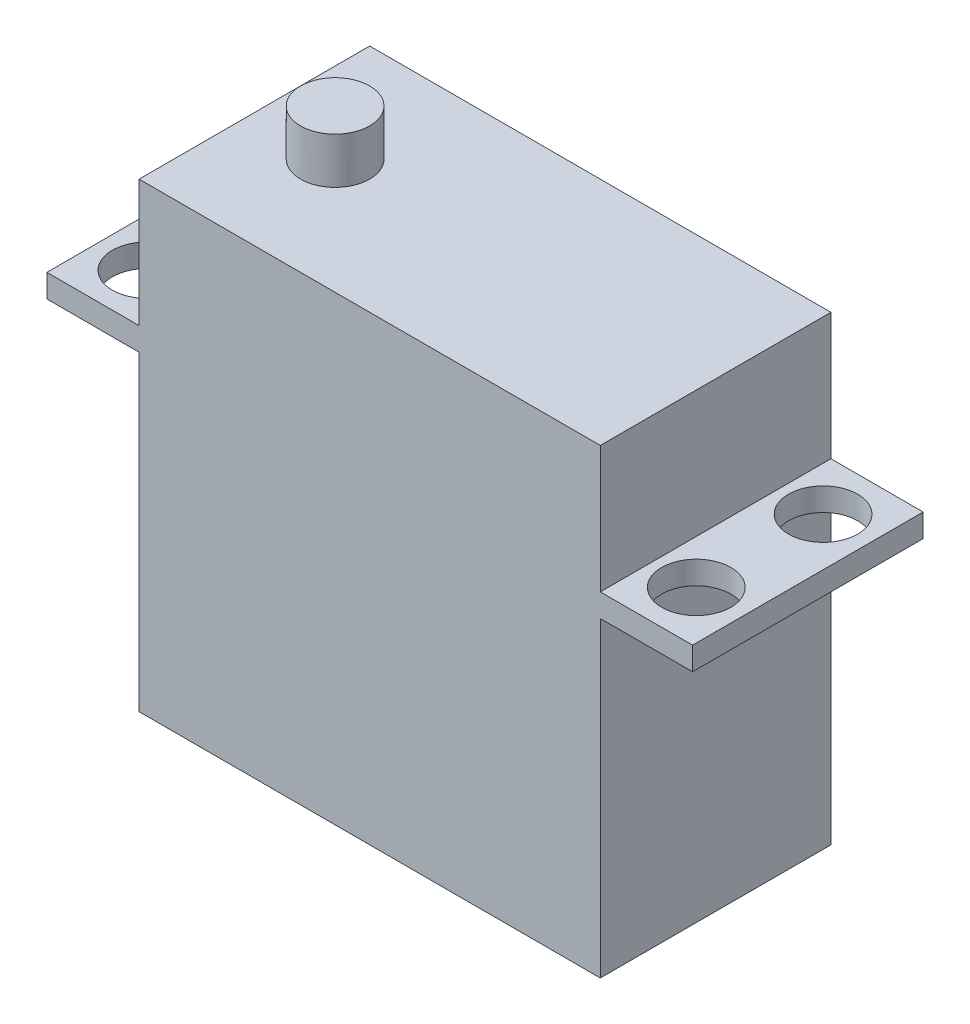
ISO-10303-21;
HEADER;
FILE_DESCRIPTION(('STEP AP214'),'2;1');
FILE_NAME('part.step','',(''),(''),'','','');
FILE_SCHEMA(('AUTOMOTIVE_DESIGN { 1 0 10303 214 1 1 1 1 }'));
ENDSEC;
DATA;
#1=APPLICATION_CONTEXT('core data for automotive mechanical design processes');
#2=APPLICATION_PROTOCOL_DEFINITION('international standard','automotive_design',2000,#1);
#3=PRODUCT_CONTEXT('',#1,'mechanical');
#4=PRODUCT('Part','Part','',(#3));
#5=PRODUCT_RELATED_PRODUCT_CATEGORY('part','',(#4));
#6=PRODUCT_DEFINITION_FORMATION('','',#4);
#7=PRODUCT_DEFINITION_CONTEXT('part definition',#1,'design');
#8=PRODUCT_DEFINITION('design','',#6,#7);
#9=PRODUCT_DEFINITION_SHAPE('','',#8);
#10=(LENGTH_UNIT() NAMED_UNIT(*) SI_UNIT(.MILLI.,.METRE.));
#11=(NAMED_UNIT(*) PLANE_ANGLE_UNIT() SI_UNIT($,.RADIAN.));
#12=(NAMED_UNIT(*) SI_UNIT($,.STERADIAN.) SOLID_ANGLE_UNIT());
#13=UNCERTAINTY_MEASURE_WITH_UNIT(LENGTH_MEASURE(1.E-05),#10,'distance_accuracy_value','');
#14=(GEOMETRIC_REPRESENTATION_CONTEXT(3) GLOBAL_UNCERTAINTY_ASSIGNED_CONTEXT((#13)) GLOBAL_UNIT_ASSIGNED_CONTEXT((#10,
#11,#12)) REPRESENTATION_CONTEXT('',''));
#15=CARTESIAN_POINT('',(0.,0.,0.));
#16=DIRECTION('',(0.,0.,1.));
#17=DIRECTION('',(1.,0.,0.));
#18=AXIS2_PLACEMENT_3D('',#15,#16,#17);
#19=CARTESIAN_POINT('',(-20.,40.,10.));
#20=DIRECTION('',(1.,0.,0.));
#21=DIRECTION('',(0.,0.,-1.));
#22=AXIS2_PLACEMENT_3D('',#19,#20,#21);
#23=PLANE('',#22);
#24=DIRECTION('',(0.,-1.,0.));
#25=VECTOR('',#24,1.);
#26=CARTESIAN_POINT('',(-20.,40.,10.));
#27=LINE('',#26,#25);
#28=CARTESIAN_POINT('',(-20.,27.,10.));
#29=VERTEX_POINT('',#28);
#30=CARTESIAN_POINT('',(-20.,0.,10.));
#31=VERTEX_POINT('',#30);
#32=EDGE_CURVE('E230',#29,#31,#27,.T.);
#33=ORIENTED_EDGE('',*,*,#32,.F.);
#34=DIRECTION('',(0.,0.,-1.));
#35=VECTOR('',#34,1.);
#36=CARTESIAN_POINT('',(-20.,27.,10.));
#37=LINE('',#36,#35);
#38=CARTESIAN_POINT('',(-20.,27.,-10.));
#39=VERTEX_POINT('',#38);
#40=EDGE_CURVE('E150',#29,#39,#37,.T.);
#41=ORIENTED_EDGE('',*,*,#40,.T.);
#42=DIRECTION('',(0.,-1.,0.));
#43=VECTOR('',#42,1.);
#44=CARTESIAN_POINT('',(-20.,40.,-10.));
#45=LINE('',#44,#43);
#46=CARTESIAN_POINT('',(-20.,0.,-10.));
#47=VERTEX_POINT('',#46);
#48=EDGE_CURVE('E232',#39,#47,#45,.T.);
#49=ORIENTED_EDGE('',*,*,#48,.T.);
#50=DIRECTION('',(0.,0.,1.));
#51=VECTOR('',#50,1.);
#52=CARTESIAN_POINT('',(-20.,0.,10.));
#53=LINE('',#52,#51);
#54=EDGE_CURVE('E224',#47,#31,#53,.T.);
#55=ORIENTED_EDGE('',*,*,#54,.T.);
#56=EDGE_LOOP('',(#33,#41,#49,#55));
#57=FACE_BOUND('',#56,.T.);
#58=ADVANCED_FACE('F39',(#57),#23,.F.);
#59=CARTESIAN_POINT('',(20.,40.,10.));
#60=DIRECTION('',(-1.,0.,0.));
#61=DIRECTION('',(0.,0.,1.));
#62=AXIS2_PLACEMENT_3D('',#59,#60,#61);
#63=PLANE('',#62);
#64=DIRECTION('',(0.,0.,1.));
#65=VECTOR('',#64,1.);
#66=CARTESIAN_POINT('',(20.,29.,10.));
#67=LINE('',#66,#65);
#68=CARTESIAN_POINT('',(20.,29.,-10.));
#69=VERTEX_POINT('',#68);
#70=CARTESIAN_POINT('',(20.,29.,10.));
#71=VERTEX_POINT('',#70);
#72=EDGE_CURVE('E183',#69,#71,#67,.T.);
#73=ORIENTED_EDGE('',*,*,#72,.F.);
#74=DIRECTION('',(0.,-1.,0.));
#75=VECTOR('',#74,1.);
#76=CARTESIAN_POINT('',(20.,40.,-10.));
#77=LINE('',#76,#75);
#78=CARTESIAN_POINT('',(20.,40.,-10.));
#79=VERTEX_POINT('',#78);
#80=EDGE_CURVE('E48',#79,#69,#77,.T.);
#81=ORIENTED_EDGE('',*,*,#80,.F.);
#82=DIRECTION('',(0.,0.,-1.));
#83=VECTOR('',#82,1.);
#84=CARTESIAN_POINT('',(20.,40.,10.));
#85=LINE('',#84,#83);
#86=CARTESIAN_POINT('',(20.,40.,10.));
#87=VERTEX_POINT('',#86);
#88=EDGE_CURVE('E208',#87,#79,#85,.T.);
#89=ORIENTED_EDGE('',*,*,#88,.F.);
#90=DIRECTION('',(0.,-1.,0.));
#91=VECTOR('',#90,1.);
#92=CARTESIAN_POINT('',(20.,40.,10.));
#93=LINE('',#92,#91);
#94=EDGE_CURVE('E228',#87,#71,#93,.T.);
#95=ORIENTED_EDGE('',*,*,#94,.T.);
#96=EDGE_LOOP('',(#73,#81,#89,#95));
#97=FACE_BOUND('',#96,.T.);
#98=ADVANCED_FACE('F41',(#97),#63,.F.);
#99=DIRECTION('',(0.,0.,-1.));
#100=VECTOR('',#99,1.);
#101=CARTESIAN_POINT('',(20.,27.,10.));
#102=LINE('',#101,#100);
#103=CARTESIAN_POINT('',(20.,27.,10.));
#104=VERTEX_POINT('',#103);
#105=CARTESIAN_POINT('',(20.,27.,-10.));
#106=VERTEX_POINT('',#105);
#107=EDGE_CURVE('E64',#104,#106,#102,.T.);
#108=ORIENTED_EDGE('',*,*,#107,.F.);
#109=CARTESIAN_POINT('',(20.,0.,10.));
#110=VERTEX_POINT('',#109);
#111=EDGE_CURVE('E218',#104,#110,#93,.T.);
#112=ORIENTED_EDGE('',*,*,#111,.T.);
#113=DIRECTION('',(0.,0.,-1.));
#114=VECTOR('',#113,1.);
#115=CARTESIAN_POINT('',(20.,0.,10.));
#116=LINE('',#115,#114);
#117=CARTESIAN_POINT('',(20.,0.,-10.));
#118=VERTEX_POINT('',#117);
#119=EDGE_CURVE('E207',#110,#118,#116,.T.);
#120=ORIENTED_EDGE('',*,*,#119,.T.);
#121=EDGE_CURVE('E236',#106,#118,#77,.T.);
#122=ORIENTED_EDGE('',*,*,#121,.F.);
#123=EDGE_LOOP('',(#108,#112,#120,#122));
#124=FACE_BOUND('',#123,.T.);
#125=ADVANCED_FACE('F275',(#124),#63,.F.);
#126=CARTESIAN_POINT('',(-20.,40.,-10.));
#127=DIRECTION('',(0.,0.,1.));
#128=DIRECTION('',(1.,0.,0.));
#129=AXIS2_PLACEMENT_3D('',#126,#127,#128);
#130=PLANE('',#129);
#131=DIRECTION('',(-1.,0.,0.));
#132=VECTOR('',#131,1.);
#133=CARTESIAN_POINT('',(-20.,0.,-10.));
#134=LINE('',#133,#132);
#135=EDGE_CURVE('E221',#118,#47,#134,.T.);
#136=ORIENTED_EDGE('',*,*,#135,.T.);
#137=ORIENTED_EDGE('',*,*,#48,.F.);
#138=DIRECTION('',(1.,0.,0.));
#139=VECTOR('',#138,1.);
#140=CARTESIAN_POINT('',(-28.,27.,-10.));
#141=LINE('',#140,#139);
#142=CARTESIAN_POINT('',(-28.,27.,-10.));
#143=VERTEX_POINT('',#142);
#144=EDGE_CURVE('E165',#143,#39,#141,.T.);
#145=ORIENTED_EDGE('',*,*,#144,.F.);
#146=DIRECTION('',(0.,1.,0.));
#147=VECTOR('',#146,1.);
#148=CARTESIAN_POINT('',(-28.,29.,-10.));
#149=LINE('',#148,#147);
#150=CARTESIAN_POINT('',(-28.,29.,-10.));
#151=VERTEX_POINT('',#150);
#152=EDGE_CURVE('E153',#143,#151,#149,.T.);
#153=ORIENTED_EDGE('',*,*,#152,.T.);
#154=DIRECTION('',(1.,0.,0.));
#155=VECTOR('',#154,1.);
#156=CARTESIAN_POINT('',(-28.,29.,-10.));
#157=LINE('',#156,#155);
#158=CARTESIAN_POINT('',(-20.,29.,-10.));
#159=VERTEX_POINT('',#158);
#160=EDGE_CURVE('E140',#151,#159,#157,.T.);
#161=ORIENTED_EDGE('',*,*,#160,.T.);
#162=CARTESIAN_POINT('',(-20.,40.,-10.));
#163=VERTEX_POINT('',#162);
#164=EDGE_CURVE('E233',#163,#159,#45,.T.);
#165=ORIENTED_EDGE('',*,*,#164,.F.);
#166=DIRECTION('',(-1.,0.,0.));
#167=VECTOR('',#166,1.);
#168=CARTESIAN_POINT('',(-20.,40.,-10.));
#169=LINE('',#168,#167);
#170=EDGE_CURVE('E211',#79,#163,#169,.T.);
#171=ORIENTED_EDGE('',*,*,#170,.F.);
#172=ORIENTED_EDGE('',*,*,#80,.T.);
#173=DIRECTION('',(-1.,0.,0.));
#174=VECTOR('',#173,1.);
#175=CARTESIAN_POINT('',(28.,29.,-10.));
#176=LINE('',#175,#174);
#177=CARTESIAN_POINT('',(28.,29.,-10.));
#178=VERTEX_POINT('',#177);
#179=EDGE_CURVE('E195',#178,#69,#176,.T.);
#180=ORIENTED_EDGE('',*,*,#179,.F.);
#181=DIRECTION('',(0.,1.,0.));
#182=VECTOR('',#181,1.);
#183=CARTESIAN_POINT('',(28.,29.,-10.));
#184=LINE('',#183,#182);
#185=CARTESIAN_POINT('',(28.,27.,-10.));
#186=VERTEX_POINT('',#185);
#187=EDGE_CURVE('E185',#186,#178,#184,.T.);
#188=ORIENTED_EDGE('',*,*,#187,.F.);
#189=DIRECTION('',(-1.,0.,0.));
#190=VECTOR('',#189,1.);
#191=CARTESIAN_POINT('',(28.,27.,-10.));
#192=LINE('',#191,#190);
#193=EDGE_CURVE('E198',#186,#106,#192,.T.);
#194=ORIENTED_EDGE('',*,*,#193,.T.);
#195=ORIENTED_EDGE('',*,*,#121,.T.);
#196=EDGE_LOOP('',(#136,#137,#145,#153,#161,#165,#171,#172,#180,#188,#194,#195));
#197=FACE_BOUND('',#196,.T.);
#198=ADVANCED_FACE('F280',(#197),#130,.F.);
#199=ORIENTED_EDGE('',*,*,#164,.T.);
#200=DIRECTION('',(0.,0.,1.));
#201=VECTOR('',#200,1.);
#202=CARTESIAN_POINT('',(-20.,29.,10.));
#203=LINE('',#202,#201);
#204=CARTESIAN_POINT('',(-20.,29.,10.));
#205=VERTEX_POINT('',#204);
#206=EDGE_CURVE('E160',#159,#205,#203,.T.);
#207=ORIENTED_EDGE('',*,*,#206,.T.);
#208=CARTESIAN_POINT('',(-20.,40.,10.));
#209=VERTEX_POINT('',#208);
#210=EDGE_CURVE('E138',#209,#205,#27,.T.);
#211=ORIENTED_EDGE('',*,*,#210,.F.);
#212=DIRECTION('',(0.,0.,1.));
#213=VECTOR('',#212,1.);
#214=CARTESIAN_POINT('',(-20.,40.,10.));
#215=LINE('',#214,#213);
#216=EDGE_CURVE('E214',#163,#209,#215,.T.);
#217=ORIENTED_EDGE('',*,*,#216,.F.);
#218=EDGE_LOOP('',(#199,#207,#211,#217));
#219=FACE_BOUND('',#218,.T.);
#220=ADVANCED_FACE('F269',(#219),#23,.F.);
#221=CARTESIAN_POINT('',(-20.,40.,10.));
#222=DIRECTION('',(0.,0.,-1.));
#223=DIRECTION('',(-1.,0.,0.));
#224=AXIS2_PLACEMENT_3D('',#221,#222,#223);
#225=PLANE('',#224);
#226=DIRECTION('',(1.,0.,0.));
#227=VECTOR('',#226,1.);
#228=CARTESIAN_POINT('',(-20.,0.,10.));
#229=LINE('',#228,#227);
#230=EDGE_CURVE('E212',#31,#110,#229,.T.);
#231=ORIENTED_EDGE('',*,*,#230,.T.);
#232=ORIENTED_EDGE('',*,*,#111,.F.);
#233=DIRECTION('',(-1.,0.,0.));
#234=VECTOR('',#233,1.);
#235=CARTESIAN_POINT('',(28.,27.,10.));
#236=LINE('',#235,#234);
#237=CARTESIAN_POINT('',(28.,27.,10.));
#238=VERTEX_POINT('',#237);
#239=EDGE_CURVE('E201',#238,#104,#236,.T.);
#240=ORIENTED_EDGE('',*,*,#239,.F.);
#241=DIRECTION('',(0.,-1.,0.));
#242=VECTOR('',#241,1.);
#243=CARTESIAN_POINT('',(28.,29.,10.));
#244=LINE('',#243,#242);
#245=CARTESIAN_POINT('',(28.,29.,10.));
#246=VERTEX_POINT('',#245);
#247=EDGE_CURVE('E179',#246,#238,#244,.T.);
#248=ORIENTED_EDGE('',*,*,#247,.F.);
#249=DIRECTION('',(-1.,0.,0.));
#250=VECTOR('',#249,1.);
#251=CARTESIAN_POINT('',(28.,29.,10.));
#252=LINE('',#251,#250);
#253=EDGE_CURVE('E189',#246,#71,#252,.T.);
#254=ORIENTED_EDGE('',*,*,#253,.T.);
#255=ORIENTED_EDGE('',*,*,#94,.F.);
#256=DIRECTION('',(1.,0.,0.));
#257=VECTOR('',#256,1.);
#258=CARTESIAN_POINT('',(-20.,40.,10.));
#259=LINE('',#258,#257);
#260=EDGE_CURVE('E216',#209,#87,#259,.T.);
#261=ORIENTED_EDGE('',*,*,#260,.F.);
#262=ORIENTED_EDGE('',*,*,#210,.T.);
#263=DIRECTION('',(1.,0.,0.));
#264=VECTOR('',#263,1.);
#265=CARTESIAN_POINT('',(-28.,29.,10.));
#266=LINE('',#265,#264);
#267=CARTESIAN_POINT('',(-28.,29.,10.));
#268=VERTEX_POINT('',#267);
#269=EDGE_CURVE('E56',#268,#205,#266,.T.);
#270=ORIENTED_EDGE('',*,*,#269,.F.);
#271=DIRECTION('',(0.,-1.,0.));
#272=VECTOR('',#271,1.);
#273=CARTESIAN_POINT('',(-28.,29.,10.));
#274=LINE('',#273,#272);
#275=CARTESIAN_POINT('',(-28.,27.,10.));
#276=VERTEX_POINT('',#275);
#277=EDGE_CURVE('E134',#268,#276,#274,.T.);
#278=ORIENTED_EDGE('',*,*,#277,.T.);
#279=DIRECTION('',(1.,0.,0.));
#280=VECTOR('',#279,1.);
#281=CARTESIAN_POINT('',(-28.,27.,10.));
#282=LINE('',#281,#280);
#283=EDGE_CURVE('E159',#276,#29,#282,.T.);
#284=ORIENTED_EDGE('',*,*,#283,.T.);
#285=ORIENTED_EDGE('',*,*,#32,.T.);
#286=EDGE_LOOP('',(#231,#232,#240,#248,#254,#255,#261,#262,#270,#278,#284,#285));
#287=FACE_BOUND('',#286,.T.);
#288=ADVANCED_FACE('F133',(#287),#225,.F.);
#289=CARTESIAN_POINT('',(0.,40.,0.));
#290=DIRECTION('',(0.,-1.,0.));
#291=DIRECTION('',(0.,0.,-1.));
#292=AXIS2_PLACEMENT_3D('',#289,#290,#291);
#293=PLANE('',#292);
#294=CARTESIAN_POINT('',(-13.,40.,0.));
#295=DIRECTION('',(0.,-1.,0.));
#296=DIRECTION('',(0.,0.,-1.));
#297=AXIS2_PLACEMENT_3D('',#294,#295,#296);
#298=CIRCLE('',#297,3.);
#299=CARTESIAN_POINT('',(-13.,40.,-3.));
#300=VERTEX_POINT('',#299);
#301=EDGE_CURVE('E11',#300,#300,#298,.F.);
#302=ORIENTED_EDGE('',*,*,#301,.F.);
#303=EDGE_LOOP('',(#302));
#304=FACE_BOUND('',#303,.T.);
#305=ORIENTED_EDGE('',*,*,#88,.T.);
#306=ORIENTED_EDGE('',*,*,#170,.T.);
#307=ORIENTED_EDGE('',*,*,#216,.T.);
#308=ORIENTED_EDGE('',*,*,#260,.T.);
#309=EDGE_LOOP('',(#305,#306,#307,#308));
#310=FACE_BOUND('',#309,.T.);
#311=ADVANCED_FACE('F285',(#304,#310),#293,.F.);
#312=CARTESIAN_POINT('',(0.,0.,0.));
#313=DIRECTION('',(0.,-1.,0.));
#314=DIRECTION('',(0.,0.,-1.));
#315=AXIS2_PLACEMENT_3D('',#312,#313,#314);
#316=PLANE('',#315);
#317=ORIENTED_EDGE('',*,*,#119,.F.);
#318=ORIENTED_EDGE('',*,*,#230,.F.);
#319=ORIENTED_EDGE('',*,*,#54,.F.);
#320=ORIENTED_EDGE('',*,*,#135,.F.);
#321=EDGE_LOOP('',(#317,#318,#319,#320));
#322=FACE_BOUND('',#321,.T.);
#323=ADVANCED_FACE('F297',(#322),#316,.T.);
#324=CARTESIAN_POINT('',(-13.,44.,0.));
#325=DIRECTION('',(0.,-1.,0.));
#326=DIRECTION('',(0.,0.,-1.));
#327=AXIS2_PLACEMENT_3D('',#324,#325,#326);
#328=CYLINDRICAL_SURFACE('',#327,3.);
#329=CARTESIAN_POINT('',(-13.,44.,0.));
#330=DIRECTION('',(0.,1.,0.));
#331=DIRECTION('',(0.,0.,1.));
#332=AXIS2_PLACEMENT_3D('',#329,#330,#331);
#333=CIRCLE('',#332,3.);
#334=CARTESIAN_POINT('',(-13.,44.,3.));
#335=VERTEX_POINT('',#334);
#336=EDGE_CURVE('E204',#335,#335,#333,.T.);
#337=ORIENTED_EDGE('',*,*,#336,.F.);
#338=EDGE_LOOP('',(#337));
#339=FACE_BOUND('',#338,.T.);
#340=ORIENTED_EDGE('',*,*,#301,.T.);
#341=EDGE_LOOP('',(#340));
#342=FACE_BOUND('',#341,.T.);
#343=ADVANCED_FACE('F322',(#339,#342),#328,.T.);
#344=CARTESIAN_POINT('',(-13.,44.,0.));
#345=DIRECTION('',(0.,1.,0.));
#346=DIRECTION('',(0.,0.,1.));
#347=AXIS2_PLACEMENT_3D('',#344,#345,#346);
#348=PLANE('',#347);
#349=ORIENTED_EDGE('',*,*,#336,.T.);
#350=EDGE_LOOP('',(#349));
#351=FACE_BOUND('',#350,.T.);
#352=ADVANCED_FACE('F327',(#351),#348,.T.);
#353=CARTESIAN_POINT('',(28.,27.,10.));
#354=DIRECTION('',(0.,1.,0.));
#355=DIRECTION('',(0.,0.,1.));
#356=AXIS2_PLACEMENT_3D('',#353,#354,#355);
#357=PLANE('',#356);
#358=CARTESIAN_POINT('',(23.8218946810905,27.,-5.5));
#359=DIRECTION('',(0.,1.,0.));
#360=DIRECTION('',(0.,0.,1.));
#361=AXIS2_PLACEMENT_3D('',#358,#359,#360);
#362=CIRCLE('',#361,3.);
#363=CARTESIAN_POINT('',(23.8218946810905,27.,-2.5));
#364=VERTEX_POINT('',#363);
#365=EDGE_CURVE('E176',#364,#364,#362,.T.);
#366=ORIENTED_EDGE('',*,*,#365,.T.);
#367=EDGE_LOOP('',(#366));
#368=FACE_BOUND('',#367,.T.);
#369=CARTESIAN_POINT('',(23.8218946810905,27.,5.5));
#370=DIRECTION('',(0.,1.,0.));
#371=DIRECTION('',(0.,0.,1.));
#372=AXIS2_PLACEMENT_3D('',#369,#370,#371);
#373=CIRCLE('',#372,3.);
#374=CARTESIAN_POINT('',(23.8218946810905,27.,8.5));
#375=VERTEX_POINT('',#374);
#376=EDGE_CURVE('E171',#375,#375,#373,.T.);
#377=ORIENTED_EDGE('',*,*,#376,.T.);
#378=EDGE_LOOP('',(#377));
#379=FACE_BOUND('',#378,.T.);
#380=ORIENTED_EDGE('',*,*,#107,.T.);
#381=ORIENTED_EDGE('',*,*,#193,.F.);
#382=DIRECTION('',(0.,0.,-1.));
#383=VECTOR('',#382,1.);
#384=CARTESIAN_POINT('',(28.,27.,10.));
#385=LINE('',#384,#383);
#386=EDGE_CURVE('E182',#238,#186,#385,.T.);
#387=ORIENTED_EDGE('',*,*,#386,.F.);
#388=ORIENTED_EDGE('',*,*,#239,.T.);
#389=EDGE_LOOP('',(#380,#381,#387,#388));
#390=FACE_BOUND('',#389,.T.);
#391=ADVANCED_FACE('F301',(#368,#379,#390),#357,.F.);
#392=CARTESIAN_POINT('',(28.,29.,10.));
#393=DIRECTION('',(0.,-1.,0.));
#394=DIRECTION('',(0.,0.,-1.));
#395=AXIS2_PLACEMENT_3D('',#392,#393,#394);
#396=PLANE('',#395);
#397=CARTESIAN_POINT('',(23.8218946810905,29.,-5.5));
#398=DIRECTION('',(0.,1.,0.));
#399=DIRECTION('',(0.,0.,1.));
#400=AXIS2_PLACEMENT_3D('',#397,#398,#399);
#401=CIRCLE('',#400,3.);
#402=CARTESIAN_POINT('',(23.8218946810905,29.,-2.5));
#403=VERTEX_POINT('',#402);
#404=EDGE_CURVE('E168',#403,#403,#401,.T.);
#405=ORIENTED_EDGE('',*,*,#404,.F.);
#406=EDGE_LOOP('',(#405));
#407=FACE_BOUND('',#406,.T.);
#408=CARTESIAN_POINT('',(23.8218946810905,29.,5.5));
#409=DIRECTION('',(0.,1.,0.));
#410=DIRECTION('',(0.,0.,1.));
#411=AXIS2_PLACEMENT_3D('',#408,#409,#410);
#412=CIRCLE('',#411,3.);
#413=CARTESIAN_POINT('',(23.8218946810905,29.,8.5));
#414=VERTEX_POINT('',#413);
#415=EDGE_CURVE('E139',#414,#414,#412,.T.);
#416=ORIENTED_EDGE('',*,*,#415,.F.);
#417=EDGE_LOOP('',(#416));
#418=FACE_BOUND('',#417,.T.);
#419=ORIENTED_EDGE('',*,*,#72,.T.);
#420=ORIENTED_EDGE('',*,*,#253,.F.);
#421=DIRECTION('',(0.,0.,1.));
#422=VECTOR('',#421,1.);
#423=CARTESIAN_POINT('',(28.,29.,10.));
#424=LINE('',#423,#422);
#425=EDGE_CURVE('E187',#178,#246,#424,.T.);
#426=ORIENTED_EDGE('',*,*,#425,.F.);
#427=ORIENTED_EDGE('',*,*,#179,.T.);
#428=EDGE_LOOP('',(#419,#420,#426,#427));
#429=FACE_BOUND('',#428,.T.);
#430=ADVANCED_FACE('F311',(#407,#418,#429),#396,.F.);
#431=CARTESIAN_POINT('',(28.,0.,0.));
#432=DIRECTION('',(1.,0.,0.));
#433=DIRECTION('',(0.,0.,-1.));
#434=AXIS2_PLACEMENT_3D('',#431,#432,#433);
#435=PLANE('',#434);
#436=ORIENTED_EDGE('',*,*,#247,.T.);
#437=ORIENTED_EDGE('',*,*,#386,.T.);
#438=ORIENTED_EDGE('',*,*,#187,.T.);
#439=ORIENTED_EDGE('',*,*,#425,.T.);
#440=EDGE_LOOP('',(#436,#437,#438,#439));
#441=FACE_BOUND('',#440,.T.);
#442=ADVANCED_FACE('F305',(#441),#435,.T.);
#443=CARTESIAN_POINT('',(23.8218946810905,0.,5.50000000000001));
#444=DIRECTION('',(0.,1.,0.));
#445=DIRECTION('',(0.,0.,1.));
#446=AXIS2_PLACEMENT_3D('',#443,#444,#445);
#447=CYLINDRICAL_SURFACE('',#446,3.);
#448=ORIENTED_EDGE('',*,*,#415,.T.);
#449=EDGE_LOOP('',(#448));
#450=FACE_BOUND('',#449,.T.);
#451=ORIENTED_EDGE('',*,*,#376,.F.);
#452=EDGE_LOOP('',(#451));
#453=FACE_BOUND('',#452,.T.);
#454=ADVANCED_FACE('F340',(#450,#453),#447,.F.);
#455=CARTESIAN_POINT('',(23.8218946810905,0.,-5.5));
#456=DIRECTION('',(0.,1.,0.));
#457=DIRECTION('',(0.,0.,1.));
#458=AXIS2_PLACEMENT_3D('',#455,#456,#457);
#459=CYLINDRICAL_SURFACE('',#458,3.);
#460=ORIENTED_EDGE('',*,*,#404,.T.);
#461=EDGE_LOOP('',(#460));
#462=FACE_BOUND('',#461,.T.);
#463=ORIENTED_EDGE('',*,*,#365,.F.);
#464=EDGE_LOOP('',(#463));
#465=FACE_BOUND('',#464,.T.);
#466=ADVANCED_FACE('F343',(#462,#465),#459,.F.);
#467=CARTESIAN_POINT('',(-28.,29.,10.));
#468=DIRECTION('',(0.,1.,0.));
#469=DIRECTION('',(0.,0.,1.));
#470=AXIS2_PLACEMENT_3D('',#467,#468,#469);
#471=PLANE('',#470);
#472=CARTESIAN_POINT('',(-23.8218946810905,29.,-5.5));
#473=DIRECTION('',(0.,-1.,0.));
#474=DIRECTION('',(0.,0.,1.));
#475=AXIS2_PLACEMENT_3D('',#472,#473,#474);
#476=CIRCLE('',#475,3.);
#477=CARTESIAN_POINT('',(-23.8218946810905,29.,-2.5));
#478=VERTEX_POINT('',#477);
#479=EDGE_CURVE('E240',#478,#478,#476,.T.);
#480=ORIENTED_EDGE('',*,*,#479,.T.);
#481=EDGE_LOOP('',(#480));
#482=FACE_BOUND('',#481,.T.);
#483=CARTESIAN_POINT('',(-23.8218946810905,29.,5.5));
#484=DIRECTION('',(0.,-1.,0.));
#485=DIRECTION('',(0.,0.,1.));
#486=AXIS2_PLACEMENT_3D('',#483,#484,#485);
#487=CIRCLE('',#486,3.);
#488=CARTESIAN_POINT('',(-23.8218946810905,29.,8.5));
#489=VERTEX_POINT('',#488);
#490=EDGE_CURVE('E245',#489,#489,#487,.T.);
#491=ORIENTED_EDGE('',*,*,#490,.T.);
#492=EDGE_LOOP('',(#491));
#493=FACE_BOUND('',#492,.T.);
#494=ORIENTED_EDGE('',*,*,#206,.F.);
#495=ORIENTED_EDGE('',*,*,#160,.F.);
#496=DIRECTION('',(0.,0.,1.));
#497=VECTOR('',#496,1.);
#498=CARTESIAN_POINT('',(-28.,29.,10.));
#499=LINE('',#498,#497);
#500=EDGE_CURVE('E146',#151,#268,#499,.T.);
#501=ORIENTED_EDGE('',*,*,#500,.T.);
#502=ORIENTED_EDGE('',*,*,#269,.T.);
#503=EDGE_LOOP('',(#494,#495,#501,#502));
#504=FACE_BOUND('',#503,.T.);
#505=ADVANCED_FACE('F152',(#482,#493,#504),#471,.T.);
#506=CARTESIAN_POINT('',(-28.,27.,10.));
#507=DIRECTION('',(0.,-1.,0.));
#508=DIRECTION('',(0.,0.,-1.));
#509=AXIS2_PLACEMENT_3D('',#506,#507,#508);
#510=PLANE('',#509);
#511=CARTESIAN_POINT('',(-23.8218946810905,27.,-5.5));
#512=DIRECTION('',(0.,-1.,0.));
#513=DIRECTION('',(0.,0.,-1.));
#514=AXIS2_PLACEMENT_3D('',#511,#512,#513);
#515=CIRCLE('',#514,3.);
#516=CARTESIAN_POINT('',(-23.8218946810905,27.,-8.5));
#517=VERTEX_POINT('',#516);
#518=EDGE_CURVE('E43',#517,#517,#515,.F.);
#519=ORIENTED_EDGE('',*,*,#518,.T.);
#520=EDGE_LOOP('',(#519));
#521=FACE_BOUND('',#520,.T.);
#522=CARTESIAN_POINT('',(-23.8218946810905,27.,5.5));
#523=DIRECTION('',(0.,-1.,0.));
#524=DIRECTION('',(0.,0.,-1.));
#525=AXIS2_PLACEMENT_3D('',#522,#523,#524);
#526=CIRCLE('',#525,3.);
#527=CARTESIAN_POINT('',(-23.8218946810905,27.,2.5));
#528=VERTEX_POINT('',#527);
#529=EDGE_CURVE('E238',#528,#528,#526,.F.);
#530=ORIENTED_EDGE('',*,*,#529,.T.);
#531=EDGE_LOOP('',(#530));
#532=FACE_BOUND('',#531,.T.);
#533=ORIENTED_EDGE('',*,*,#40,.F.);
#534=ORIENTED_EDGE('',*,*,#283,.F.);
#535=DIRECTION('',(0.,0.,-1.));
#536=VECTOR('',#535,1.);
#537=CARTESIAN_POINT('',(-28.,27.,10.));
#538=LINE('',#537,#536);
#539=EDGE_CURVE('E149',#276,#143,#538,.T.);
#540=ORIENTED_EDGE('',*,*,#539,.T.);
#541=ORIENTED_EDGE('',*,*,#144,.T.);
#542=EDGE_LOOP('',(#533,#534,#540,#541));
#543=FACE_BOUND('',#542,.T.);
#544=ADVANCED_FACE('F264',(#521,#532,#543),#510,.T.);
#545=CARTESIAN_POINT('',(-28.,0.,0.));
#546=DIRECTION('',(-1.,0.,0.));
#547=DIRECTION('',(0.,0.,-1.));
#548=AXIS2_PLACEMENT_3D('',#545,#546,#547);
#549=PLANE('',#548);
#550=ORIENTED_EDGE('',*,*,#277,.F.);
#551=ORIENTED_EDGE('',*,*,#500,.F.);
#552=ORIENTED_EDGE('',*,*,#152,.F.);
#553=ORIENTED_EDGE('',*,*,#539,.F.);
#554=EDGE_LOOP('',(#550,#551,#552,#553));
#555=FACE_BOUND('',#554,.T.);
#556=ADVANCED_FACE('F144',(#555),#549,.T.);
#557=CARTESIAN_POINT('',(-23.8218946810905,0.,5.50000000000001));
#558=DIRECTION('',(0.,1.,0.));
#559=DIRECTION('',(0.,0.,1.));
#560=AXIS2_PLACEMENT_3D('',#557,#558,#559);
#561=CYLINDRICAL_SURFACE('',#560,3.);
#562=ORIENTED_EDGE('',*,*,#529,.F.);
#563=EDGE_LOOP('',(#562));
#564=FACE_BOUND('',#563,.T.);
#565=ORIENTED_EDGE('',*,*,#490,.F.);
#566=EDGE_LOOP('',(#565));
#567=FACE_BOUND('',#566,.T.);
#568=ADVANCED_FACE('F253',(#564,#567),#561,.F.);
#569=CARTESIAN_POINT('',(-23.8218946810905,0.,-5.5));
#570=DIRECTION('',(0.,1.,0.));
#571=DIRECTION('',(0.,0.,1.));
#572=AXIS2_PLACEMENT_3D('',#569,#570,#571);
#573=CYLINDRICAL_SURFACE('',#572,3.);
#574=ORIENTED_EDGE('',*,*,#518,.F.);
#575=EDGE_LOOP('',(#574));
#576=FACE_BOUND('',#575,.T.);
#577=ORIENTED_EDGE('',*,*,#479,.F.);
#578=EDGE_LOOP('',(#577));
#579=FACE_BOUND('',#578,.T.);
#580=ADVANCED_FACE('F255',(#576,#579),#573,.F.);
#581=CLOSED_SHELL('',(#58,#98,#125,#198,#220,#288,#311,#323,#343,#352,#391,#430,#442,#454,#466,
#505,#544,#556,#568,#580));
#582=MANIFOLD_SOLID_BREP('B2',#581);
#583=ADVANCED_BREP_SHAPE_REPRESENTATION('',(#18,#582),#14);
#584=SHAPE_DEFINITION_REPRESENTATION(#9,#583);
ENDSEC;
END-ISO-10303-21;
